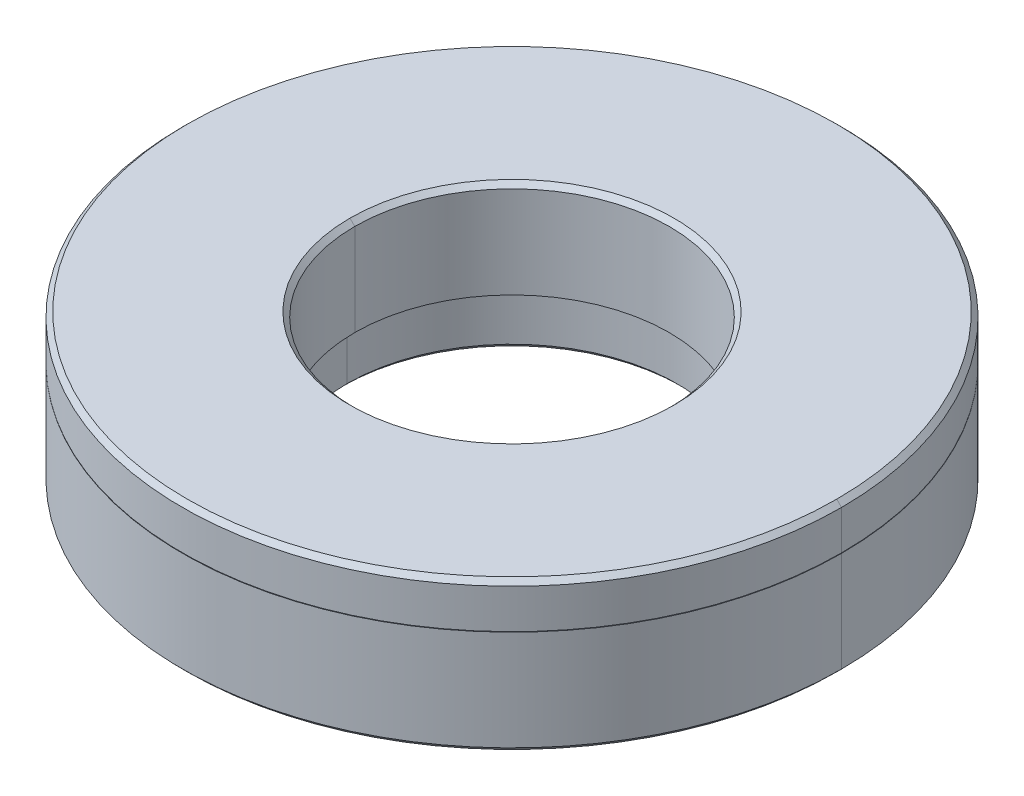
ISO-10303-21;
HEADER;
FILE_DESCRIPTION(('STEP AP214'),'2;1');
FILE_NAME('part.step','',(''),(''),'','','');
FILE_SCHEMA(('AUTOMOTIVE_DESIGN { 1 0 10303 214 1 1 1 1 }'));
ENDSEC;
DATA;
#1=APPLICATION_CONTEXT('core data for automotive mechanical design processes');
#2=APPLICATION_PROTOCOL_DEFINITION('international standard','automotive_design',2000,#1);
#3=PRODUCT_CONTEXT('',#1,'mechanical');
#4=PRODUCT('Part','Part','',(#3));
#5=PRODUCT_RELATED_PRODUCT_CATEGORY('part','',(#4));
#6=PRODUCT_DEFINITION_FORMATION('','',#4);
#7=PRODUCT_DEFINITION_CONTEXT('part definition',#1,'design');
#8=PRODUCT_DEFINITION('design','',#6,#7);
#9=PRODUCT_DEFINITION_SHAPE('','',#8);
#10=(LENGTH_UNIT() NAMED_UNIT(*) SI_UNIT(.MILLI.,.METRE.));
#11=(NAMED_UNIT(*) PLANE_ANGLE_UNIT() SI_UNIT($,.RADIAN.));
#12=(NAMED_UNIT(*) SI_UNIT($,.STERADIAN.) SOLID_ANGLE_UNIT());
#13=UNCERTAINTY_MEASURE_WITH_UNIT(LENGTH_MEASURE(1.E-05),#10,'distance_accuracy_value','');
#14=(GEOMETRIC_REPRESENTATION_CONTEXT(3) GLOBAL_UNCERTAINTY_ASSIGNED_CONTEXT((#13)) GLOBAL_UNIT_ASSIGNED_CONTEXT((#10,
#11,#12)) REPRESENTATION_CONTEXT('',''));
#15=CARTESIAN_POINT('',(0.,0.,0.));
#16=DIRECTION('',(0.,0.,1.));
#17=DIRECTION('',(1.,0.,0.));
#18=AXIS2_PLACEMENT_3D('',#15,#16,#17);
#19=CARTESIAN_POINT('',(0.,46.4387983769292,0.));
#20=DIRECTION('',(-1.,0.,0.));
#21=DIRECTION('',(0.,0.,-1.));
#22=AXIS2_PLACEMENT_3D('',#19,#20,#21);
#23=SPHERICAL_SURFACE('',#22,44.45);
#24=CARTESIAN_POINT('',(0.,46.4387983769292,0.));
#25=DIRECTION('',(0.,0.,1.));
#26=DIRECTION('',(-1.,0.,0.));
#27=AXIS2_PLACEMENT_3D('',#24,#25,#26);
#28=CIRCLE('',#27,44.45);
#29=CARTESIAN_POINT('',(-8.73759999999849,2.85603978778006,0.));
#30=VERTEX_POINT('',#29);
#31=CARTESIAN_POINT('',(-17.4624999999995,5.56260000000042,0.));
#32=VERTEX_POINT('',#31);
#33=EDGE_CURVE('P0_E58',#30,#32,#28,.F.);
#34=ORIENTED_EDGE('',*,*,#33,.T.);
#35=CARTESIAN_POINT('',(0.,5.5626,0.));
#36=DIRECTION('',(0.,-1.,0.));
#37=DIRECTION('',(0.,0.,-1.));
#38=AXIS2_PLACEMENT_3D('',#35,#36,#37);
#39=CIRCLE('',#38,17.4625);
#40=CARTESIAN_POINT('',(17.4624999999995,5.56260000000042,0.));
#41=VERTEX_POINT('',#40);
#42=EDGE_CURVE('P0_E73',#41,#32,#39,.T.);
#43=ORIENTED_EDGE('',*,*,#42,.F.);
#44=CARTESIAN_POINT('',(0.,46.4387983769292,0.));
#45=DIRECTION('',(0.,0.,1.));
#46=DIRECTION('',(-1.,0.,0.));
#47=AXIS2_PLACEMENT_3D('',#44,#45,#46);
#48=CIRCLE('',#47,44.45);
#49=CARTESIAN_POINT('',(8.73759999999849,2.85603978778006,0.));
#50=VERTEX_POINT('',#49);
#51=EDGE_CURVE('P0_E63',#41,#50,#48,.F.);
#52=ORIENTED_EDGE('',*,*,#51,.T.);
#53=CARTESIAN_POINT('',(0.,2.85603978777946,0.));
#54=DIRECTION('',(0.,-1.,0.));
#55=DIRECTION('',(0.,0.,-1.));
#56=AXIS2_PLACEMENT_3D('',#53,#54,#55);
#57=CIRCLE('',#56,8.7376);
#58=EDGE_CURVE('P0_E90',#50,#30,#57,.T.);
#59=ORIENTED_EDGE('',*,*,#58,.T.);
#60=EDGE_LOOP('',(#34,#43,#52,#59));
#61=FACE_BOUND('',#60,.T.);
#62=ADVANCED_FACE('P0_F16',(#61),#23,.F.);
#63=CARTESIAN_POINT('',(0.,46.4387983769292,0.));
#64=DIRECTION('',(-1.,0.,0.));
#65=DIRECTION('',(0.,0.,-1.));
#66=AXIS2_PLACEMENT_3D('',#63,#64,#65);
#67=SPHERICAL_SURFACE('',#66,44.45);
#68=ORIENTED_EDGE('',*,*,#33,.F.);
#69=CARTESIAN_POINT('',(0.,2.85603978777946,0.));
#70=DIRECTION('',(0.,-1.,0.));
#71=DIRECTION('',(0.,0.,-1.));
#72=AXIS2_PLACEMENT_3D('',#69,#70,#71);
#73=CIRCLE('',#72,8.7376);
#74=EDGE_CURVE('P0_E68',#30,#50,#73,.T.);
#75=ORIENTED_EDGE('',*,*,#74,.T.);
#76=ORIENTED_EDGE('',*,*,#51,.F.);
#77=CARTESIAN_POINT('',(0.,5.5626,0.));
#78=DIRECTION('',(0.,-1.,0.));
#79=DIRECTION('',(0.,0.,-1.));
#80=AXIS2_PLACEMENT_3D('',#77,#78,#79);
#81=CIRCLE('',#80,17.4625);
#82=EDGE_CURVE('P0_E20',#32,#41,#81,.T.);
#83=ORIENTED_EDGE('',*,*,#82,.F.);
#84=EDGE_LOOP('',(#68,#75,#76,#83));
#85=FACE_BOUND('',#84,.T.);
#86=ADVANCED_FACE('P0_F64',(#85),#67,.F.);
#87=CARTESIAN_POINT('',(0.,5.84073,0.));
#88=DIRECTION('',(0.,-1.,0.));
#89=DIRECTION('',(0.,0.,-1.));
#90=AXIS2_PLACEMENT_3D('',#87,#88,#89);
#91=CYLINDRICAL_SURFACE('',#90,17.4625);
#92=ORIENTED_EDGE('',*,*,#82,.T.);
#93=DIRECTION('',(0.,-1.,0.));
#94=VECTOR('',#93,1.);
#95=CARTESIAN_POINT('',(17.4625,5.84073,0.));
#96=LINE('',#95,#94);
#97=CARTESIAN_POINT('',(17.4625,0.254000000000018,0.));
#98=VERTEX_POINT('',#97);
#99=EDGE_CURVE('P0_E83',#98,#41,#96,.F.);
#100=ORIENTED_EDGE('',*,*,#99,.F.);
#101=CARTESIAN_POINT('',(0.,0.254000000000018,0.));
#102=DIRECTION('',(0.,1.,0.));
#103=DIRECTION('',(1.,0.,0.));
#104=AXIS2_PLACEMENT_3D('',#101,#102,#103);
#105=CIRCLE('',#104,17.4625);
#106=CARTESIAN_POINT('',(-17.4625,0.254000000000018,0.));
#107=VERTEX_POINT('',#106);
#108=EDGE_CURVE('P0_E150',#107,#98,#105,.F.);
#109=ORIENTED_EDGE('',*,*,#108,.F.);
#110=DIRECTION('',(0.,-1.,0.));
#111=VECTOR('',#110,1.);
#112=CARTESIAN_POINT('',(-17.4625,5.84073,0.));
#113=LINE('',#112,#111);
#114=EDGE_CURVE('P0_E77',#32,#107,#113,.T.);
#115=ORIENTED_EDGE('',*,*,#114,.F.);
#116=EDGE_LOOP('',(#92,#100,#109,#115));
#117=FACE_BOUND('',#116,.T.);
#118=ADVANCED_FACE('P0_F80',(#117),#91,.T.);
#119=CARTESIAN_POINT('',(0.,5.84073,0.));
#120=DIRECTION('',(0.,-1.,0.));
#121=DIRECTION('',(0.,0.,-1.));
#122=AXIS2_PLACEMENT_3D('',#119,#120,#121);
#123=CYLINDRICAL_SURFACE('',#122,17.4625);
#124=CARTESIAN_POINT('',(0.,0.254000000000018,0.));
#125=DIRECTION('',(0.,1.,0.));
#126=DIRECTION('',(1.,0.,0.));
#127=AXIS2_PLACEMENT_3D('',#124,#125,#126);
#128=CIRCLE('',#127,17.4625);
#129=EDGE_CURVE('P0_E88',#98,#107,#128,.F.);
#130=ORIENTED_EDGE('',*,*,#129,.F.);
#131=ORIENTED_EDGE('',*,*,#99,.T.);
#132=ORIENTED_EDGE('',*,*,#42,.T.);
#133=ORIENTED_EDGE('',*,*,#114,.T.);
#134=EDGE_LOOP('',(#130,#131,#132,#133));
#135=FACE_BOUND('',#134,.T.);
#136=ADVANCED_FACE('P0_F86',(#135),#123,.T.);
#137=CARTESIAN_POINT('',(0.,5.84073,0.));
#138=DIRECTION('',(0.,-1.,0.));
#139=DIRECTION('',(0.,0.,-1.));
#140=AXIS2_PLACEMENT_3D('',#137,#138,#139);
#141=CYLINDRICAL_SURFACE('',#140,8.7376);
#142=DIRECTION('',(0.,-1.,0.));
#143=VECTOR('',#142,1.);
#144=CARTESIAN_POINT('',(-8.7376,5.84073,0.));
#145=LINE('',#144,#143);
#146=CARTESIAN_POINT('',(-8.73760000000001,0.25400000000002,0.));
#147=VERTEX_POINT('',#146);
#148=EDGE_CURVE('P0_E151',#147,#30,#145,.F.);
#149=ORIENTED_EDGE('',*,*,#148,.T.);
#150=ORIENTED_EDGE('',*,*,#58,.F.);
#151=DIRECTION('',(0.,-1.,0.));
#152=VECTOR('',#151,1.);
#153=CARTESIAN_POINT('',(8.7376,5.84073,0.));
#154=LINE('',#153,#152);
#155=CARTESIAN_POINT('',(8.73760000000001,0.254000000000015,0.));
#156=VERTEX_POINT('',#155);
#157=EDGE_CURVE('P0_E92',#50,#156,#154,.T.);
#158=ORIENTED_EDGE('',*,*,#157,.T.);
#159=CARTESIAN_POINT('',(0.,0.25400000000002,0.));
#160=DIRECTION('',(0.,-1.,0.));
#161=DIRECTION('',(-1.,0.,0.));
#162=AXIS2_PLACEMENT_3D('',#159,#160,#161);
#163=CIRCLE('',#162,8.73760000000002);
#164=EDGE_CURVE('P0_E163',#156,#147,#163,.T.);
#165=ORIENTED_EDGE('',*,*,#164,.T.);
#166=EDGE_LOOP('',(#149,#150,#158,#165));
#167=FACE_BOUND('',#166,.T.);
#168=ADVANCED_FACE('P0_F106',(#167),#141,.F.);
#169=CARTESIAN_POINT('',(0.,5.84073,0.));
#170=DIRECTION('',(0.,-1.,0.));
#171=DIRECTION('',(0.,0.,-1.));
#172=AXIS2_PLACEMENT_3D('',#169,#170,#171);
#173=CYLINDRICAL_SURFACE('',#172,8.7376);
#174=ORIENTED_EDGE('',*,*,#148,.F.);
#175=CARTESIAN_POINT('',(0.,0.25400000000002,0.));
#176=DIRECTION('',(0.,-1.,0.));
#177=DIRECTION('',(-1.,0.,0.));
#178=AXIS2_PLACEMENT_3D('',#175,#176,#177);
#179=CIRCLE('',#178,8.73760000000002);
#180=EDGE_CURVE('P0_E146',#147,#156,#179,.T.);
#181=ORIENTED_EDGE('',*,*,#180,.T.);
#182=ORIENTED_EDGE('',*,*,#157,.F.);
#183=ORIENTED_EDGE('',*,*,#74,.F.);
#184=EDGE_LOOP('',(#174,#181,#182,#183));
#185=FACE_BOUND('',#184,.T.);
#186=ADVANCED_FACE('P0_F109',(#185),#173,.F.);
#187=CARTESIAN_POINT('',(0.,0.254000000000019,0.));
#188=DIRECTION('',(0.,1.,0.));
#189=DIRECTION('',(0.,0.,1.));
#190=AXIS2_PLACEMENT_3D('',#187,#188,#189);
#191=CONICAL_SURFACE('',#190,17.4625,0.7853981633973);
#192=DIRECTION('',(0.707106781186443,-0.707106781186652,0.));
#193=VECTOR('',#192,1.);
#194=CARTESIAN_POINT('',(-17.3355,0.127,0.));
#195=LINE('',#194,#193);
#196=CARTESIAN_POINT('',(-17.2085,0.,0.));
#197=VERTEX_POINT('',#196);
#198=EDGE_CURVE('P0_E152',#107,#197,#195,.T.);
#199=ORIENTED_EDGE('',*,*,#198,.F.);
#200=ORIENTED_EDGE('',*,*,#108,.T.);
#201=DIRECTION('',(-0.707106781186443,-0.707106781186652,0.));
#202=VECTOR('',#201,1.);
#203=CARTESIAN_POINT('',(17.3355,0.127,0.));
#204=LINE('',#203,#202);
#205=CARTESIAN_POINT('',(17.2085,0.,0.));
#206=VERTEX_POINT('',#205);
#207=EDGE_CURVE('P0_E165',#206,#98,#204,.F.);
#208=ORIENTED_EDGE('',*,*,#207,.F.);
#209=CARTESIAN_POINT('',(0.,0.,0.));
#210=DIRECTION('',(0.,1.,0.));
#211=DIRECTION('',(0.,0.,1.));
#212=AXIS2_PLACEMENT_3D('',#209,#210,#211);
#213=CIRCLE('',#212,17.2085);
#214=EDGE_CURVE('P0_E139',#197,#206,#213,.F.);
#215=ORIENTED_EDGE('',*,*,#214,.F.);
#216=EDGE_LOOP('',(#199,#200,#208,#215));
#217=FACE_BOUND('',#216,.T.);
#218=ADVANCED_FACE('P0_F113',(#217),#191,.T.);
#219=CARTESIAN_POINT('',(0.,0.254000000000019,0.));
#220=DIRECTION('',(0.,1.,0.));
#221=DIRECTION('',(0.,0.,1.));
#222=AXIS2_PLACEMENT_3D('',#219,#220,#221);
#223=CONICAL_SURFACE('',#222,17.4625,0.7853981633973);
#224=ORIENTED_EDGE('',*,*,#207,.T.);
#225=ORIENTED_EDGE('',*,*,#129,.T.);
#226=ORIENTED_EDGE('',*,*,#198,.T.);
#227=CARTESIAN_POINT('',(0.,0.,0.));
#228=DIRECTION('',(0.,1.,0.));
#229=DIRECTION('',(0.,0.,1.));
#230=AXIS2_PLACEMENT_3D('',#227,#228,#229);
#231=CIRCLE('',#230,17.2085);
#232=EDGE_CURVE('P0_E141',#206,#197,#231,.F.);
#233=ORIENTED_EDGE('',*,*,#232,.F.);
#234=EDGE_LOOP('',(#224,#225,#226,#233));
#235=FACE_BOUND('',#234,.T.);
#236=ADVANCED_FACE('P0_F117',(#235),#223,.T.);
#237=CARTESIAN_POINT('',(0.,0.,0.));
#238=DIRECTION('',(0.,-1.,0.));
#239=DIRECTION('',(0.,0.,-1.));
#240=AXIS2_PLACEMENT_3D('',#237,#238,#239);
#241=CONICAL_SURFACE('',#240,8.99159999999998,0.785398163397301);
#242=ORIENTED_EDGE('',*,*,#164,.F.);
#243=DIRECTION('',(-0.707106781186443,0.707106781186652,0.));
#244=VECTOR('',#243,1.);
#245=CARTESIAN_POINT('',(8.8646,0.127,0.));
#246=LINE('',#245,#244);
#247=CARTESIAN_POINT('',(8.99159999999998,0.,0.));
#248=VERTEX_POINT('',#247);
#249=EDGE_CURVE('P0_E35',#156,#248,#246,.F.);
#250=ORIENTED_EDGE('',*,*,#249,.T.);
#251=CARTESIAN_POINT('',(0.,0.,0.));
#252=DIRECTION('',(0.,-1.,0.));
#253=DIRECTION('',(0.,0.,-1.));
#254=AXIS2_PLACEMENT_3D('',#251,#252,#253);
#255=CIRCLE('',#254,8.99159999999998);
#256=CARTESIAN_POINT('',(-8.99159999999998,0.,0.));
#257=VERTEX_POINT('',#256);
#258=EDGE_CURVE('P0_E26',#257,#248,#255,.F.);
#259=ORIENTED_EDGE('',*,*,#258,.F.);
#260=DIRECTION('',(0.707106781186443,0.707106781186652,0.));
#261=VECTOR('',#260,1.);
#262=CARTESIAN_POINT('',(-8.8646,0.127,0.));
#263=LINE('',#262,#261);
#264=EDGE_CURVE('P0_E162',#257,#147,#263,.T.);
#265=ORIENTED_EDGE('',*,*,#264,.T.);
#266=EDGE_LOOP('',(#242,#250,#259,#265));
#267=FACE_BOUND('',#266,.T.);
#268=ADVANCED_FACE('P0_F121',(#267),#241,.F.);
#269=CARTESIAN_POINT('',(0.,0.,0.));
#270=DIRECTION('',(0.,-1.,0.));
#271=DIRECTION('',(0.,0.,-1.));
#272=AXIS2_PLACEMENT_3D('',#269,#270,#271);
#273=CONICAL_SURFACE('',#272,8.99159999999998,0.785398163397301);
#274=ORIENTED_EDGE('',*,*,#180,.F.);
#275=ORIENTED_EDGE('',*,*,#264,.F.);
#276=CARTESIAN_POINT('',(0.,0.,0.));
#277=DIRECTION('',(0.,-1.,0.));
#278=DIRECTION('',(0.,0.,-1.));
#279=AXIS2_PLACEMENT_3D('',#276,#277,#278);
#280=CIRCLE('',#279,8.99159999999998);
#281=EDGE_CURVE('P0_E11',#248,#257,#280,.F.);
#282=ORIENTED_EDGE('',*,*,#281,.F.);
#283=ORIENTED_EDGE('',*,*,#249,.F.);
#284=EDGE_LOOP('',(#274,#275,#282,#283));
#285=FACE_BOUND('',#284,.T.);
#286=ADVANCED_FACE('P0_F125',(#285),#273,.F.);
#287=CARTESIAN_POINT('',(0.,0.,0.));
#288=DIRECTION('',(0.,-1.,0.));
#289=DIRECTION('',(0.,0.,-1.));
#290=AXIS2_PLACEMENT_3D('',#287,#288,#289);
#291=PLANE('',#290);
#292=ORIENTED_EDGE('',*,*,#258,.T.);
#293=ORIENTED_EDGE('',*,*,#281,.T.);
#294=EDGE_LOOP('',(#292,#293));
#295=FACE_BOUND('',#294,.T.);
#296=ORIENTED_EDGE('',*,*,#214,.T.);
#297=ORIENTED_EDGE('',*,*,#232,.T.);
#298=EDGE_LOOP('',(#296,#297));
#299=FACE_BOUND('',#298,.T.);
#300=ADVANCED_FACE('P0_F128',(#295,#299),#291,.T.);
#301=CLOSED_SHELL('',(#62,#86,#118,#136,#168,#186,#218,#236,#268,#286,#300));
#302=MANIFOLD_SOLID_BREP('P0_B1',#301);
#303=CARTESIAN_POINT('',(0.,46.4641983769292,0.));
#304=DIRECTION('',(-1.,0.,0.));
#305=DIRECTION('',(0.,0.,-1.));
#306=AXIS2_PLACEMENT_3D('',#303,#304,#305);
#307=SPHERICAL_SURFACE('',#306,44.45);
#308=CARTESIAN_POINT('',(0.,2.8019308389262,0.));
#309=DIRECTION('',(0.,-1.,0.));
#310=DIRECTION('',(0.,0.,-1.));
#311=AXIS2_PLACEMENT_3D('',#308,#309,#310);
#312=CIRCLE('',#311,8.3312);
#313=CARTESIAN_POINT('',(-8.33119999999775,2.80193083892706,0.));
#314=VERTEX_POINT('',#313);
#315=CARTESIAN_POINT('',(8.33119999999775,2.80193083892706,0.));
#316=VERTEX_POINT('',#315);
#317=EDGE_CURVE('P1_E88',#314,#316,#312,.F.);
#318=ORIENTED_EDGE('',*,*,#317,.T.);
#319=CARTESIAN_POINT('',(0.,46.4641983769292,0.));
#320=DIRECTION('',(0.,0.,1.));
#321=DIRECTION('',(-1.,0.,0.));
#322=AXIS2_PLACEMENT_3D('',#319,#320,#321);
#323=CIRCLE('',#322,44.45);
#324=CARTESIAN_POINT('',(17.4624999999995,5.58800000000042,0.));
#325=VERTEX_POINT('',#324);
#326=EDGE_CURVE('P1_E58',#325,#316,#323,.F.);
#327=ORIENTED_EDGE('',*,*,#326,.F.);
#328=CARTESIAN_POINT('',(0.,5.588,0.));
#329=DIRECTION('',(0.,-1.,0.));
#330=DIRECTION('',(0.,0.,-1.));
#331=AXIS2_PLACEMENT_3D('',#328,#329,#330);
#332=CIRCLE('',#331,17.4625);
#333=CARTESIAN_POINT('',(-17.4624999999995,5.58800000000042,0.));
#334=VERTEX_POINT('',#333);
#335=EDGE_CURVE('P1_E84',#334,#325,#332,.F.);
#336=ORIENTED_EDGE('',*,*,#335,.F.);
#337=CARTESIAN_POINT('',(0.,46.4641983769292,0.));
#338=DIRECTION('',(0.,0.,1.));
#339=DIRECTION('',(-1.,0.,0.));
#340=AXIS2_PLACEMENT_3D('',#337,#338,#339);
#341=CIRCLE('',#340,44.45);
#342=EDGE_CURVE('P1_E65',#314,#334,#341,.F.);
#343=ORIENTED_EDGE('',*,*,#342,.F.);
#344=EDGE_LOOP('',(#318,#327,#336,#343));
#345=FACE_BOUND('',#344,.T.);
#346=ADVANCED_FACE('P1_F16',(#345),#307,.T.);
#347=CARTESIAN_POINT('',(0.,46.4641983769292,0.));
#348=DIRECTION('',(-1.,0.,0.));
#349=DIRECTION('',(0.,0.,-1.));
#350=AXIS2_PLACEMENT_3D('',#347,#348,#349);
#351=SPHERICAL_SURFACE('',#350,44.45);
#352=CARTESIAN_POINT('',(0.,5.588,0.));
#353=DIRECTION('',(0.,-1.,0.));
#354=DIRECTION('',(0.,0.,-1.));
#355=AXIS2_PLACEMENT_3D('',#352,#353,#354);
#356=CIRCLE('',#355,17.4625);
#357=EDGE_CURVE('P1_E20',#325,#334,#356,.F.);
#358=ORIENTED_EDGE('',*,*,#357,.F.);
#359=ORIENTED_EDGE('',*,*,#326,.T.);
#360=CARTESIAN_POINT('',(0.,2.8019308389262,0.));
#361=DIRECTION('',(0.,-1.,0.));
#362=DIRECTION('',(0.,0.,-1.));
#363=AXIS2_PLACEMENT_3D('',#360,#361,#362);
#364=CIRCLE('',#363,8.3312);
#365=EDGE_CURVE('P1_E70',#316,#314,#364,.F.);
#366=ORIENTED_EDGE('',*,*,#365,.T.);
#367=ORIENTED_EDGE('',*,*,#342,.T.);
#368=EDGE_LOOP('',(#358,#359,#366,#367));
#369=FACE_BOUND('',#368,.T.);
#370=ADVANCED_FACE('P1_F67',(#369),#351,.T.);
#371=CARTESIAN_POINT('',(0.,8.18094345805242,0.));
#372=DIRECTION('',(0.,-1.,0.));
#373=DIRECTION('',(0.,0.,-1.));
#374=AXIS2_PLACEMENT_3D('',#371,#372,#373);
#375=CYLINDRICAL_SURFACE('',#374,17.4625);
#376=CARTESIAN_POINT('',(0.,7.67079999999998,0.));
#377=DIRECTION('',(0.,-1.,0.));
#378=DIRECTION('',(-1.,0.,0.));
#379=AXIS2_PLACEMENT_3D('',#376,#377,#378);
#380=CIRCLE('',#379,17.4625);
#381=CARTESIAN_POINT('',(17.4625,7.67079999999999,0.));
#382=VERTEX_POINT('',#381);
#383=CARTESIAN_POINT('',(-17.4625,7.67079999999998,0.));
#384=VERTEX_POINT('',#383);
#385=EDGE_CURVE('P1_E149',#382,#384,#380,.F.);
#386=ORIENTED_EDGE('',*,*,#385,.F.);
#387=DIRECTION('',(0.,-1.,0.));
#388=VECTOR('',#387,1.);
#389=CARTESIAN_POINT('',(17.4625,8.18094345805242,0.));
#390=LINE('',#389,#388);
#391=EDGE_CURVE('P1_E81',#325,#382,#390,.F.);
#392=ORIENTED_EDGE('',*,*,#391,.F.);
#393=ORIENTED_EDGE('',*,*,#357,.T.);
#394=DIRECTION('',(0.,-1.,0.));
#395=VECTOR('',#394,1.);
#396=CARTESIAN_POINT('',(-17.4625,8.18094345805242,0.));
#397=LINE('',#396,#395);
#398=EDGE_CURVE('P1_E78',#384,#334,#397,.T.);
#399=ORIENTED_EDGE('',*,*,#398,.F.);
#400=EDGE_LOOP('',(#386,#392,#393,#399));
#401=FACE_BOUND('',#400,.T.);
#402=ADVANCED_FACE('P1_F77',(#401),#375,.T.);
#403=CARTESIAN_POINT('',(0.,8.18094345805242,0.));
#404=DIRECTION('',(0.,-1.,0.));
#405=DIRECTION('',(0.,0.,-1.));
#406=AXIS2_PLACEMENT_3D('',#403,#404,#405);
#407=CYLINDRICAL_SURFACE('',#406,17.4625);
#408=ORIENTED_EDGE('',*,*,#335,.T.);
#409=ORIENTED_EDGE('',*,*,#391,.T.);
#410=CARTESIAN_POINT('',(0.,7.67079999999998,0.));
#411=DIRECTION('',(0.,-1.,0.));
#412=DIRECTION('',(-1.,0.,0.));
#413=AXIS2_PLACEMENT_3D('',#410,#411,#412);
#414=CIRCLE('',#413,17.4625);
#415=EDGE_CURVE('P1_E86',#384,#382,#414,.F.);
#416=ORIENTED_EDGE('',*,*,#415,.F.);
#417=ORIENTED_EDGE('',*,*,#398,.T.);
#418=EDGE_LOOP('',(#408,#409,#416,#417));
#419=FACE_BOUND('',#418,.T.);
#420=ADVANCED_FACE('P1_F83',(#419),#407,.T.);
#421=CARTESIAN_POINT('',(0.,8.18094345805242,0.));
#422=DIRECTION('',(0.,-1.,0.));
#423=DIRECTION('',(0.,0.,-1.));
#424=AXIS2_PLACEMENT_3D('',#421,#422,#423);
#425=CYLINDRICAL_SURFACE('',#424,8.3312);
#426=DIRECTION('',(0.,-1.,0.));
#427=VECTOR('',#426,1.);
#428=CARTESIAN_POINT('',(-8.3312,8.18094345805242,0.));
#429=LINE('',#428,#427);
#430=CARTESIAN_POINT('',(-8.33120000000002,7.67079999999999,0.));
#431=VERTEX_POINT('',#430);
#432=EDGE_CURVE('P1_E94',#314,#431,#429,.F.);
#433=ORIENTED_EDGE('',*,*,#432,.T.);
#434=CARTESIAN_POINT('',(0.,7.67079999999998,0.));
#435=DIRECTION('',(0.,1.,0.));
#436=DIRECTION('',(1.,0.,0.));
#437=AXIS2_PLACEMENT_3D('',#434,#435,#436);
#438=CIRCLE('',#437,8.33120000000002);
#439=CARTESIAN_POINT('',(8.33120000000002,7.67079999999999,0.));
#440=VERTEX_POINT('',#439);
#441=EDGE_CURVE('P1_E153',#431,#440,#438,.T.);
#442=ORIENTED_EDGE('',*,*,#441,.T.);
#443=DIRECTION('',(0.,-1.,0.));
#444=VECTOR('',#443,1.);
#445=CARTESIAN_POINT('',(8.3312,8.18094345805242,0.));
#446=LINE('',#445,#444);
#447=EDGE_CURVE('P1_E92',#440,#316,#446,.T.);
#448=ORIENTED_EDGE('',*,*,#447,.T.);
#449=ORIENTED_EDGE('',*,*,#317,.F.);
#450=EDGE_LOOP('',(#433,#442,#448,#449));
#451=FACE_BOUND('',#450,.T.);
#452=ADVANCED_FACE('P1_F112',(#451),#425,.F.);
#453=CARTESIAN_POINT('',(0.,8.18094345805242,0.));
#454=DIRECTION('',(0.,-1.,0.));
#455=DIRECTION('',(0.,0.,-1.));
#456=AXIS2_PLACEMENT_3D('',#453,#454,#455);
#457=CYLINDRICAL_SURFACE('',#456,8.3312);
#458=ORIENTED_EDGE('',*,*,#432,.F.);
#459=ORIENTED_EDGE('',*,*,#365,.F.);
#460=ORIENTED_EDGE('',*,*,#447,.F.);
#461=CARTESIAN_POINT('',(0.,7.67079999999998,0.));
#462=DIRECTION('',(0.,1.,0.));
#463=DIRECTION('',(1.,0.,0.));
#464=AXIS2_PLACEMENT_3D('',#461,#462,#463);
#465=CIRCLE('',#464,8.33120000000002);
#466=EDGE_CURVE('P1_E156',#440,#431,#465,.T.);
#467=ORIENTED_EDGE('',*,*,#466,.T.);
#468=EDGE_LOOP('',(#458,#459,#460,#467));
#469=FACE_BOUND('',#468,.T.);
#470=ADVANCED_FACE('P1_F115',(#469),#457,.F.);
#471=CARTESIAN_POINT('',(0.,7.67079999999998,0.));
#472=DIRECTION('',(0.,-1.,0.));
#473=DIRECTION('',(0.,0.,-1.));
#474=AXIS2_PLACEMENT_3D('',#471,#472,#473);
#475=CONICAL_SURFACE('',#474,17.4625,0.785398163397296);
#476=DIRECTION('',(0.707106781186443,0.707106781186652,0.));
#477=VECTOR('',#476,1.);
#478=CARTESIAN_POINT('',(-17.3355,7.7978,0.));
#479=LINE('',#478,#477);
#480=CARTESIAN_POINT('',(-17.2085,7.92480000000002,0.));
#481=VERTEX_POINT('',#480);
#482=EDGE_CURVE('P1_E148',#481,#384,#479,.F.);
#483=ORIENTED_EDGE('',*,*,#482,.F.);
#484=CARTESIAN_POINT('',(0.,7.92480000000002,0.));
#485=DIRECTION('',(0.,-1.,0.));
#486=DIRECTION('',(0.,0.,-1.));
#487=AXIS2_PLACEMENT_3D('',#484,#485,#486);
#488=CIRCLE('',#487,17.2085);
#489=CARTESIAN_POINT('',(17.2085,7.92480000000002,0.));
#490=VERTEX_POINT('',#489);
#491=EDGE_CURVE('P1_E95',#481,#490,#488,.T.);
#492=ORIENTED_EDGE('',*,*,#491,.T.);
#493=DIRECTION('',(-0.707106781186443,0.707106781186652,0.));
#494=VECTOR('',#493,1.);
#495=CARTESIAN_POINT('',(17.3355,7.7978,0.));
#496=LINE('',#495,#494);
#497=EDGE_CURVE('P1_E151',#382,#490,#496,.T.);
#498=ORIENTED_EDGE('',*,*,#497,.F.);
#499=ORIENTED_EDGE('',*,*,#385,.T.);
#500=EDGE_LOOP('',(#483,#492,#498,#499));
#501=FACE_BOUND('',#500,.T.);
#502=ADVANCED_FACE('P1_F119',(#501),#475,.T.);
#503=CARTESIAN_POINT('',(0.,7.67079999999998,0.));
#504=DIRECTION('',(0.,-1.,0.));
#505=DIRECTION('',(0.,0.,-1.));
#506=AXIS2_PLACEMENT_3D('',#503,#504,#505);
#507=CONICAL_SURFACE('',#506,17.4625,0.785398163397296);
#508=ORIENTED_EDGE('',*,*,#497,.T.);
#509=CARTESIAN_POINT('',(0.,7.92480000000002,0.));
#510=DIRECTION('',(0.,-1.,0.));
#511=DIRECTION('',(0.,0.,-1.));
#512=AXIS2_PLACEMENT_3D('',#509,#510,#511);
#513=CIRCLE('',#512,17.2085);
#514=EDGE_CURVE('P1_E98',#490,#481,#513,.T.);
#515=ORIENTED_EDGE('',*,*,#514,.T.);
#516=ORIENTED_EDGE('',*,*,#482,.T.);
#517=ORIENTED_EDGE('',*,*,#415,.T.);
#518=EDGE_LOOP('',(#508,#515,#516,#517));
#519=FACE_BOUND('',#518,.T.);
#520=ADVANCED_FACE('P1_F123',(#519),#507,.T.);
#521=CARTESIAN_POINT('',(0.,7.92480000000002,0.));
#522=DIRECTION('',(0.,1.,0.));
#523=DIRECTION('',(0.,0.,1.));
#524=AXIS2_PLACEMENT_3D('',#521,#522,#523);
#525=CONICAL_SURFACE('',#524,8.58519999999998,0.7853981633973);
#526=CARTESIAN_POINT('',(0.,7.92480000000002,0.));
#527=DIRECTION('',(0.,1.,0.));
#528=DIRECTION('',(0.,0.,1.));
#529=AXIS2_PLACEMENT_3D('',#526,#527,#528);
#530=CIRCLE('',#529,8.58519999999998);
#531=CARTESIAN_POINT('',(-8.58519999999998,7.92480000000002,0.));
#532=VERTEX_POINT('',#531);
#533=CARTESIAN_POINT('',(8.58519999999998,7.92480000000002,0.));
#534=VERTEX_POINT('',#533);
#535=EDGE_CURVE('P1_E26',#532,#534,#530,.T.);
#536=ORIENTED_EDGE('',*,*,#535,.T.);
#537=DIRECTION('',(-0.707106781186443,-0.707106781186652,0.));
#538=VECTOR('',#537,1.);
#539=CARTESIAN_POINT('',(8.4582,7.7978,0.));
#540=LINE('',#539,#538);
#541=EDGE_CURVE('P1_E34',#534,#440,#540,.T.);
#542=ORIENTED_EDGE('',*,*,#541,.T.);
#543=ORIENTED_EDGE('',*,*,#441,.F.);
#544=DIRECTION('',(0.707106781186443,-0.707106781186652,0.));
#545=VECTOR('',#544,1.);
#546=CARTESIAN_POINT('',(-8.4582,7.7978,0.));
#547=LINE('',#546,#545);
#548=EDGE_CURVE('P1_E164',#431,#532,#547,.F.);
#549=ORIENTED_EDGE('',*,*,#548,.T.);
#550=EDGE_LOOP('',(#536,#542,#543,#549));
#551=FACE_BOUND('',#550,.T.);
#552=ADVANCED_FACE('P1_F127',(#551),#525,.F.);
#553=CARTESIAN_POINT('',(0.,7.92480000000002,0.));
#554=DIRECTION('',(0.,1.,0.));
#555=DIRECTION('',(0.,0.,1.));
#556=AXIS2_PLACEMENT_3D('',#553,#554,#555);
#557=CONICAL_SURFACE('',#556,8.58519999999998,0.7853981633973);
#558=CARTESIAN_POINT('',(0.,7.92480000000002,0.));
#559=DIRECTION('',(0.,1.,0.));
#560=DIRECTION('',(0.,0.,1.));
#561=AXIS2_PLACEMENT_3D('',#558,#559,#560);
#562=CIRCLE('',#561,8.58519999999998);
#563=EDGE_CURVE('P1_E10',#534,#532,#562,.T.);
#564=ORIENTED_EDGE('',*,*,#563,.T.);
#565=ORIENTED_EDGE('',*,*,#548,.F.);
#566=ORIENTED_EDGE('',*,*,#466,.F.);
#567=ORIENTED_EDGE('',*,*,#541,.F.);
#568=EDGE_LOOP('',(#564,#565,#566,#567));
#569=FACE_BOUND('',#568,.T.);
#570=ADVANCED_FACE('P1_F131',(#569),#557,.F.);
#571=CARTESIAN_POINT('',(0.,7.9248,0.));
#572=DIRECTION('',(0.,-1.,0.));
#573=DIRECTION('',(0.,0.,-1.));
#574=AXIS2_PLACEMENT_3D('',#571,#572,#573);
#575=PLANE('',#574);
#576=ORIENTED_EDGE('',*,*,#535,.F.);
#577=ORIENTED_EDGE('',*,*,#563,.F.);
#578=EDGE_LOOP('',(#576,#577));
#579=FACE_BOUND('',#578,.T.);
#580=ORIENTED_EDGE('',*,*,#491,.F.);
#581=ORIENTED_EDGE('',*,*,#514,.F.);
#582=EDGE_LOOP('',(#580,#581));
#583=FACE_BOUND('',#582,.T.);
#584=ADVANCED_FACE('P1_F135',(#579,#583),#575,.F.);
#585=CLOSED_SHELL('',(#346,#370,#402,#420,#452,#470,#502,#520,#552,#570,#584));
#586=MANIFOLD_SOLID_BREP('P1_B1',#585);
#587=ADVANCED_BREP_SHAPE_REPRESENTATION('',(#18,#302,#586),#14);
#588=SHAPE_DEFINITION_REPRESENTATION(#9,#587);
ENDSEC;
END-ISO-10303-21;
